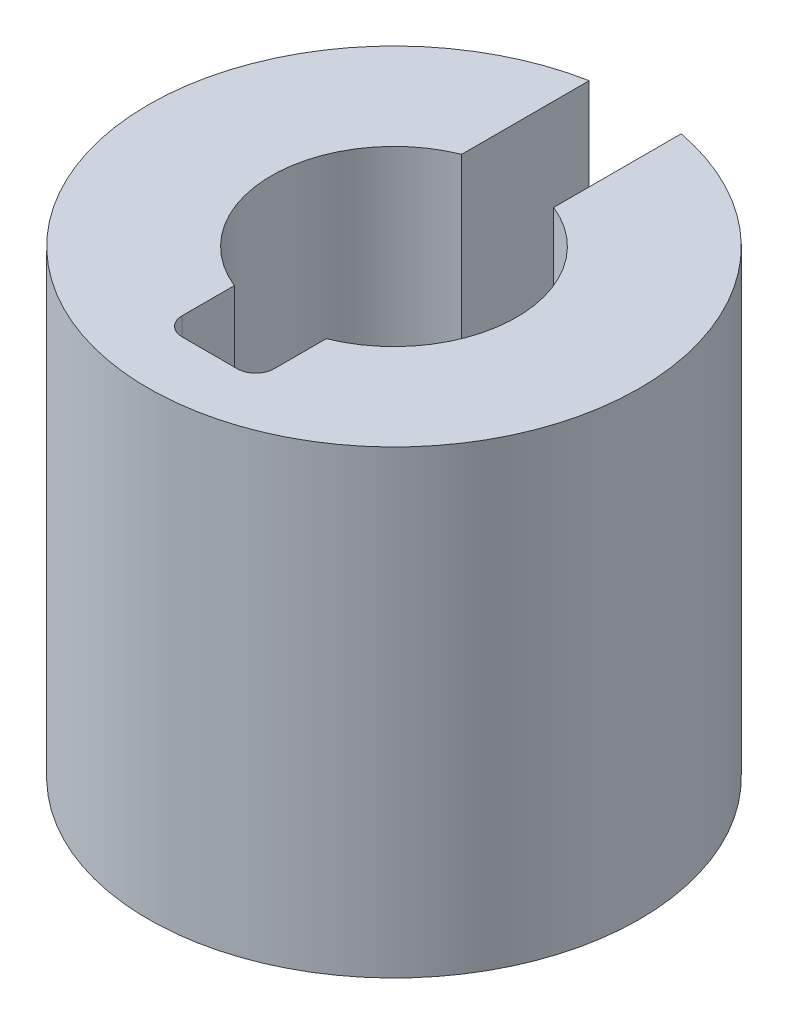
ISO-10303-21;
HEADER;
FILE_DESCRIPTION(('STEP AP214'),'2;1');
FILE_NAME('part.step','',(''),(''),'','','');
FILE_SCHEMA(('AUTOMOTIVE_DESIGN { 1 0 10303 214 1 1 1 1 }'));
ENDSEC;
DATA;
#1=APPLICATION_CONTEXT('core data for automotive mechanical design processes');
#2=APPLICATION_PROTOCOL_DEFINITION('international standard','automotive_design',2000,#1);
#3=PRODUCT_CONTEXT('',#1,'mechanical');
#4=PRODUCT('Part','Part','',(#3));
#5=PRODUCT_RELATED_PRODUCT_CATEGORY('part','',(#4));
#6=PRODUCT_DEFINITION_FORMATION('','',#4);
#7=PRODUCT_DEFINITION_CONTEXT('part definition',#1,'design');
#8=PRODUCT_DEFINITION('design','',#6,#7);
#9=PRODUCT_DEFINITION_SHAPE('','',#8);
#10=(LENGTH_UNIT() NAMED_UNIT(*) SI_UNIT(.MILLI.,.METRE.));
#11=(NAMED_UNIT(*) PLANE_ANGLE_UNIT() SI_UNIT($,.RADIAN.));
#12=(NAMED_UNIT(*) SI_UNIT($,.STERADIAN.) SOLID_ANGLE_UNIT());
#13=UNCERTAINTY_MEASURE_WITH_UNIT(LENGTH_MEASURE(1.E-05),#10,'distance_accuracy_value','');
#14=(GEOMETRIC_REPRESENTATION_CONTEXT(3) GLOBAL_UNCERTAINTY_ASSIGNED_CONTEXT((#13)) GLOBAL_UNIT_ASSIGNED_CONTEXT((#10,
#11,#12)) REPRESENTATION_CONTEXT('',''));
#15=CARTESIAN_POINT('',(0.,0.,0.));
#16=DIRECTION('',(0.,0.,1.));
#17=DIRECTION('',(1.,0.,0.));
#18=AXIS2_PLACEMENT_3D('',#15,#16,#17);
#19=CARTESIAN_POINT('',(-0.75,3.75,3.005));
#20=DIRECTION('',(0.,0.,1.));
#21=DIRECTION('',(1.,0.,0.));
#22=AXIS2_PLACEMENT_3D('',#19,#20,#21);
#23=PLANE('',#22);
#24=DIRECTION('',(0.,1.,0.));
#25=VECTOR('',#24,1.);
#26=CARTESIAN_POINT('',(-0.45,3.75,3.005));
#27=LINE('',#26,#25);
#28=CARTESIAN_POINT('',(-0.45,-3.75,3.005));
#29=VERTEX_POINT('',#28);
#30=CARTESIAN_POINT('',(-0.45,3.75,3.005));
#31=VERTEX_POINT('',#30);
#32=EDGE_CURVE('E114',#29,#31,#27,.T.);
#33=ORIENTED_EDGE('',*,*,#32,.T.);
#34=DIRECTION('',(1.,0.,0.));
#35=VECTOR('',#34,1.);
#36=CARTESIAN_POINT('',(-0.75,3.75,3.005));
#37=LINE('',#36,#35);
#38=CARTESIAN_POINT('',(0.45,3.75,3.005));
#39=VERTEX_POINT('',#38);
#40=EDGE_CURVE('E102',#39,#31,#37,.F.);
#41=ORIENTED_EDGE('',*,*,#40,.F.);
#42=DIRECTION('',(0.,1.,0.));
#43=VECTOR('',#42,1.);
#44=CARTESIAN_POINT('',(0.45,3.75,3.005));
#45=LINE('',#44,#43);
#46=CARTESIAN_POINT('',(0.45,-3.75,3.005));
#47=VERTEX_POINT('',#46);
#48=EDGE_CURVE('E101',#39,#47,#45,.F.);
#49=ORIENTED_EDGE('',*,*,#48,.T.);
#50=DIRECTION('',(1.,0.,0.));
#51=VECTOR('',#50,1.);
#52=CARTESIAN_POINT('',(-0.75,-3.75,3.005));
#53=LINE('',#52,#51);
#54=EDGE_CURVE('E91',#29,#47,#53,.T.);
#55=ORIENTED_EDGE('',*,*,#54,.F.);
#56=EDGE_LOOP('',(#33,#41,#49,#55));
#57=FACE_BOUND('',#56,.T.);
#58=ADVANCED_FACE('F16',(#57),#23,.F.);
#59=CARTESIAN_POINT('',(0.45,3.75,2.705));
#60=DIRECTION('',(0.,1.,0.));
#61=DIRECTION('',(0.,0.,1.));
#62=AXIS2_PLACEMENT_3D('',#59,#60,#61);
#63=CYLINDRICAL_SURFACE('',#62,0.3);
#64=DIRECTION('',(0.,1.,0.));
#65=VECTOR('',#64,1.);
#66=CARTESIAN_POINT('',(0.75,3.75,2.705));
#67=LINE('',#66,#65);
#68=CARTESIAN_POINT('',(0.75,3.75,2.705));
#69=VERTEX_POINT('',#68);
#70=CARTESIAN_POINT('',(0.75,-3.75,2.705));
#71=VERTEX_POINT('',#70);
#72=EDGE_CURVE('E111',#69,#71,#67,.F.);
#73=ORIENTED_EDGE('',*,*,#72,.T.);
#74=CARTESIAN_POINT('',(0.45,-3.75,2.705));
#75=DIRECTION('',(0.,1.,0.));
#76=DIRECTION('',(0.,0.,1.));
#77=AXIS2_PLACEMENT_3D('',#74,#75,#76);
#78=CIRCLE('',#77,0.3);
#79=EDGE_CURVE('E19',#47,#71,#78,.T.);
#80=ORIENTED_EDGE('',*,*,#79,.F.);
#81=ORIENTED_EDGE('',*,*,#48,.F.);
#82=CARTESIAN_POINT('',(0.45,3.75,2.705));
#83=DIRECTION('',(0.,1.,0.));
#84=DIRECTION('',(0.,0.,1.));
#85=AXIS2_PLACEMENT_3D('',#82,#83,#84);
#86=CIRCLE('',#85,0.3);
#87=EDGE_CURVE('E113',#69,#39,#86,.F.);
#88=ORIENTED_EDGE('',*,*,#87,.F.);
#89=EDGE_LOOP('',(#73,#80,#81,#88));
#90=FACE_BOUND('',#89,.T.);
#91=ADVANCED_FACE('F109',(#90),#63,.F.);
#92=CARTESIAN_POINT('',(-0.45,3.75,2.705));
#93=DIRECTION('',(0.,1.,0.));
#94=DIRECTION('',(0.,0.,1.));
#95=AXIS2_PLACEMENT_3D('',#92,#93,#94);
#96=CYLINDRICAL_SURFACE('',#95,0.3);
#97=ORIENTED_EDGE('',*,*,#32,.F.);
#98=CARTESIAN_POINT('',(-0.45,-3.75,2.705));
#99=DIRECTION('',(0.,1.,0.));
#100=DIRECTION('',(0.,0.,1.));
#101=AXIS2_PLACEMENT_3D('',#98,#99,#100);
#102=CIRCLE('',#101,0.3);
#103=CARTESIAN_POINT('',(-0.75,-3.75,2.705));
#104=VERTEX_POINT('',#103);
#105=EDGE_CURVE('E97',#104,#29,#102,.T.);
#106=ORIENTED_EDGE('',*,*,#105,.F.);
#107=DIRECTION('',(0.,1.,0.));
#108=VECTOR('',#107,1.);
#109=CARTESIAN_POINT('',(-0.75,3.75,2.705));
#110=LINE('',#109,#108);
#111=CARTESIAN_POINT('',(-0.75,3.75,2.705));
#112=VERTEX_POINT('',#111);
#113=EDGE_CURVE('E145',#104,#112,#110,.T.);
#114=ORIENTED_EDGE('',*,*,#113,.T.);
#115=CARTESIAN_POINT('',(-0.45,3.75,2.705));
#116=DIRECTION('',(0.,1.,0.));
#117=DIRECTION('',(0.,0.,1.));
#118=AXIS2_PLACEMENT_3D('',#115,#116,#117);
#119=CIRCLE('',#118,0.3);
#120=EDGE_CURVE('E117',#31,#112,#119,.F.);
#121=ORIENTED_EDGE('',*,*,#120,.F.);
#122=EDGE_LOOP('',(#97,#106,#114,#121));
#123=FACE_BOUND('',#122,.T.);
#124=ADVANCED_FACE('F183',(#123),#96,.F.);
#125=CARTESIAN_POINT('',(0.75,3.75,3.005));
#126=DIRECTION('',(1.,0.,0.));
#127=DIRECTION('',(0.,0.,-1.));
#128=AXIS2_PLACEMENT_3D('',#125,#126,#127);
#129=PLANE('',#128);
#130=ORIENTED_EDGE('',*,*,#72,.F.);
#131=DIRECTION('',(0.,0.,-1.));
#132=VECTOR('',#131,1.);
#133=CARTESIAN_POINT('',(0.75,3.75,3.005));
#134=LINE('',#133,#132);
#135=CARTESIAN_POINT('',(0.75,3.75,1.85404962177392));
#136=VERTEX_POINT('',#135);
#137=EDGE_CURVE('E119',#136,#69,#134,.F.);
#138=ORIENTED_EDGE('',*,*,#137,.F.);
#139=DIRECTION('',(0.,-1.,0.));
#140=VECTOR('',#139,1.);
#141=CARTESIAN_POINT('',(0.75,3.75,1.85404962177392));
#142=LINE('',#141,#140);
#143=CARTESIAN_POINT('',(0.75,-3.75,1.85404962177392));
#144=VERTEX_POINT('',#143);
#145=EDGE_CURVE('E153',#136,#144,#142,.T.);
#146=ORIENTED_EDGE('',*,*,#145,.T.);
#147=DIRECTION('',(0.,0.,-1.));
#148=VECTOR('',#147,1.);
#149=CARTESIAN_POINT('',(0.75,-3.75,3.005));
#150=LINE('',#149,#148);
#151=EDGE_CURVE('E144',#71,#144,#150,.T.);
#152=ORIENTED_EDGE('',*,*,#151,.F.);
#153=EDGE_LOOP('',(#130,#138,#146,#152));
#154=FACE_BOUND('',#153,.T.);
#155=ADVANCED_FACE('F180',(#154),#129,.F.);
#156=CARTESIAN_POINT('',(-0.75,3.75,3.005));
#157=DIRECTION('',(-1.,0.,0.));
#158=DIRECTION('',(0.,0.,1.));
#159=AXIS2_PLACEMENT_3D('',#156,#157,#158);
#160=PLANE('',#159);
#161=ORIENTED_EDGE('',*,*,#113,.F.);
#162=DIRECTION('',(0.,0.,1.));
#163=VECTOR('',#162,1.);
#164=CARTESIAN_POINT('',(-0.75,-3.75,3.005));
#165=LINE('',#164,#163);
#166=CARTESIAN_POINT('',(-0.75,-3.75,1.85404962177392));
#167=VERTEX_POINT('',#166);
#168=EDGE_CURVE('E149',#167,#104,#165,.T.);
#169=ORIENTED_EDGE('',*,*,#168,.F.);
#170=DIRECTION('',(0.,-1.,0.));
#171=VECTOR('',#170,1.);
#172=CARTESIAN_POINT('',(-0.749999999999999,3.75,1.85404962177392));
#173=LINE('',#172,#171);
#174=CARTESIAN_POINT('',(-0.75,3.75,1.85404962177392));
#175=VERTEX_POINT('',#174);
#176=EDGE_CURVE('E123',#167,#175,#173,.F.);
#177=ORIENTED_EDGE('',*,*,#176,.T.);
#178=DIRECTION('',(0.,0.,1.));
#179=VECTOR('',#178,1.);
#180=CARTESIAN_POINT('',(-0.75,3.75,3.005));
#181=LINE('',#180,#179);
#182=EDGE_CURVE('E148',#112,#175,#181,.F.);
#183=ORIENTED_EDGE('',*,*,#182,.F.);
#184=EDGE_LOOP('',(#161,#169,#177,#183));
#185=FACE_BOUND('',#184,.T.);
#186=ADVANCED_FACE('F182',(#185),#160,.F.);
#187=CARTESIAN_POINT('',(0.,3.75,0.));
#188=DIRECTION('',(0.,-1.,0.));
#189=DIRECTION('',(0.,0.,-1.));
#190=AXIS2_PLACEMENT_3D('',#187,#188,#189);
#191=CYLINDRICAL_SURFACE('',#190,2.);
#192=ORIENTED_EDGE('',*,*,#145,.F.);
#193=CARTESIAN_POINT('',(0.,3.75,0.));
#194=DIRECTION('',(0.,-1.,0.));
#195=DIRECTION('',(0.,0.,-1.));
#196=AXIS2_PLACEMENT_3D('',#193,#194,#195);
#197=CIRCLE('',#196,2.);
#198=CARTESIAN_POINT('',(0.75,3.75,-1.85404962177392));
#199=VERTEX_POINT('',#198);
#200=EDGE_CURVE('E127',#199,#136,#197,.T.);
#201=ORIENTED_EDGE('',*,*,#200,.F.);
#202=DIRECTION('',(0.,1.,0.));
#203=VECTOR('',#202,1.);
#204=CARTESIAN_POINT('',(0.75,3.75,-1.85404962177392));
#205=LINE('',#204,#203);
#206=CARTESIAN_POINT('',(0.75,-3.75,-1.85404962177392));
#207=VERTEX_POINT('',#206);
#208=EDGE_CURVE('E126',#199,#207,#205,.F.);
#209=ORIENTED_EDGE('',*,*,#208,.T.);
#210=CARTESIAN_POINT('',(0.,-3.75,0.));
#211=DIRECTION('',(0.,-1.,0.));
#212=DIRECTION('',(0.,0.,-1.));
#213=AXIS2_PLACEMENT_3D('',#210,#211,#212);
#214=CIRCLE('',#213,2.);
#215=EDGE_CURVE('E122',#207,#144,#214,.T.);
#216=ORIENTED_EDGE('',*,*,#215,.T.);
#217=EDGE_LOOP('',(#192,#201,#209,#216));
#218=FACE_BOUND('',#217,.T.);
#219=ADVANCED_FACE('F178',(#218),#191,.F.);
#220=CARTESIAN_POINT('',(0.,3.75,0.));
#221=DIRECTION('',(0.,-1.,0.));
#222=DIRECTION('',(0.,0.,-1.));
#223=AXIS2_PLACEMENT_3D('',#220,#221,#222);
#224=CYLINDRICAL_SURFACE('',#223,2.);
#225=DIRECTION('',(0.,1.,0.));
#226=VECTOR('',#225,1.);
#227=CARTESIAN_POINT('',(-0.75,3.75,-1.85404962177392));
#228=LINE('',#227,#226);
#229=CARTESIAN_POINT('',(-0.75,-3.75,-1.85404962177392));
#230=VERTEX_POINT('',#229);
#231=CARTESIAN_POINT('',(-0.75,3.75,-1.85404962177392));
#232=VERTEX_POINT('',#231);
#233=EDGE_CURVE('E160',#230,#232,#228,.T.);
#234=ORIENTED_EDGE('',*,*,#233,.T.);
#235=CARTESIAN_POINT('',(0.,3.75,0.));
#236=DIRECTION('',(0.,-1.,0.));
#237=DIRECTION('',(0.,0.,-1.));
#238=AXIS2_PLACEMENT_3D('',#235,#236,#237);
#239=CIRCLE('',#238,2.);
#240=EDGE_CURVE('E130',#175,#232,#239,.T.);
#241=ORIENTED_EDGE('',*,*,#240,.F.);
#242=ORIENTED_EDGE('',*,*,#176,.F.);
#243=CARTESIAN_POINT('',(0.,-3.75,0.));
#244=DIRECTION('',(0.,-1.,0.));
#245=DIRECTION('',(0.,0.,-1.));
#246=AXIS2_PLACEMENT_3D('',#243,#244,#245);
#247=CIRCLE('',#246,2.);
#248=EDGE_CURVE('E120',#167,#230,#247,.T.);
#249=ORIENTED_EDGE('',*,*,#248,.T.);
#250=EDGE_LOOP('',(#234,#241,#242,#249));
#251=FACE_BOUND('',#250,.T.);
#252=ADVANCED_FACE('F211',(#251),#224,.F.);
#253=CARTESIAN_POINT('',(0.,-3.75,0.));
#254=DIRECTION('',(0.,1.,0.));
#255=DIRECTION('',(0.,0.,1.));
#256=AXIS2_PLACEMENT_3D('',#253,#254,#255);
#257=PLANE('',#256);
#258=DIRECTION('',(0.,0.,-1.));
#259=VECTOR('',#258,1.);
#260=CARTESIAN_POINT('',(0.75,-3.75,-1.85404962177392));
#261=LINE('',#260,#259);
#262=CARTESIAN_POINT('',(0.75,-3.75,-3.9341485737069));
#263=VERTEX_POINT('',#262);
#264=EDGE_CURVE('E131',#207,#263,#261,.T.);
#265=ORIENTED_EDGE('',*,*,#264,.T.);
#266=CARTESIAN_POINT('',(0.,-3.75,0.));
#267=DIRECTION('',(0.,-1.,0.));
#268=DIRECTION('',(0.,0.,-1.));
#269=AXIS2_PLACEMENT_3D('',#266,#267,#268);
#270=CIRCLE('',#269,4.005);
#271=CARTESIAN_POINT('',(-0.75,-3.75,-3.9341485737069));
#272=VERTEX_POINT('',#271);
#273=EDGE_CURVE('E134',#272,#263,#270,.F.);
#274=ORIENTED_EDGE('',*,*,#273,.F.);
#275=DIRECTION('',(0.,0.,1.));
#276=VECTOR('',#275,1.);
#277=CARTESIAN_POINT('',(-0.75,-3.75,-1.85404962177392));
#278=LINE('',#277,#276);
#279=EDGE_CURVE('E138',#272,#230,#278,.T.);
#280=ORIENTED_EDGE('',*,*,#279,.T.);
#281=ORIENTED_EDGE('',*,*,#248,.F.);
#282=ORIENTED_EDGE('',*,*,#168,.T.);
#283=ORIENTED_EDGE('',*,*,#105,.T.);
#284=ORIENTED_EDGE('',*,*,#54,.T.);
#285=ORIENTED_EDGE('',*,*,#79,.T.);
#286=ORIENTED_EDGE('',*,*,#151,.T.);
#287=ORIENTED_EDGE('',*,*,#215,.F.);
#288=EDGE_LOOP('',(#265,#274,#280,#281,#282,#283,#284,#285,#286,#287));
#289=FACE_BOUND('',#288,.T.);
#290=ADVANCED_FACE('F93',(#289),#257,.F.);
#291=CARTESIAN_POINT('',(0.75,3.75,-1.85404962177392));
#292=DIRECTION('',(1.,0.,0.));
#293=DIRECTION('',(0.,0.,-1.));
#294=AXIS2_PLACEMENT_3D('',#291,#292,#293);
#295=PLANE('',#294);
#296=ORIENTED_EDGE('',*,*,#208,.F.);
#297=DIRECTION('',(0.,0.,1.));
#298=VECTOR('',#297,1.);
#299=CARTESIAN_POINT('',(0.75,3.75,0.));
#300=LINE('',#299,#298);
#301=CARTESIAN_POINT('',(0.75,3.75,-3.9341485737069));
#302=VERTEX_POINT('',#301);
#303=EDGE_CURVE('E133',#302,#199,#300,.T.);
#304=ORIENTED_EDGE('',*,*,#303,.F.);
#305=DIRECTION('',(0.,-1.,0.));
#306=VECTOR('',#305,1.);
#307=CARTESIAN_POINT('',(0.75,3.75,-3.9341485737069));
#308=LINE('',#307,#306);
#309=EDGE_CURVE('E137',#263,#302,#308,.F.);
#310=ORIENTED_EDGE('',*,*,#309,.F.);
#311=ORIENTED_EDGE('',*,*,#264,.F.);
#312=EDGE_LOOP('',(#296,#304,#310,#311));
#313=FACE_BOUND('',#312,.T.);
#314=ADVANCED_FACE('F173',(#313),#295,.F.);
#315=CARTESIAN_POINT('',(0.,3.75,0.));
#316=DIRECTION('',(0.,1.,0.));
#317=DIRECTION('',(0.,0.,1.));
#318=AXIS2_PLACEMENT_3D('',#315,#316,#317);
#319=PLANE('',#318);
#320=CARTESIAN_POINT('',(0.,3.75,0.));
#321=DIRECTION('',(0.,-1.,0.));
#322=DIRECTION('',(0.,0.,-1.));
#323=AXIS2_PLACEMENT_3D('',#320,#321,#322);
#324=CIRCLE('',#323,4.005);
#325=CARTESIAN_POINT('',(-0.75,3.75,-3.9341485737069));
#326=VERTEX_POINT('',#325);
#327=EDGE_CURVE('E25',#302,#326,#324,.T.);
#328=ORIENTED_EDGE('',*,*,#327,.F.);
#329=ORIENTED_EDGE('',*,*,#303,.T.);
#330=ORIENTED_EDGE('',*,*,#200,.T.);
#331=ORIENTED_EDGE('',*,*,#137,.T.);
#332=ORIENTED_EDGE('',*,*,#87,.T.);
#333=ORIENTED_EDGE('',*,*,#40,.T.);
#334=ORIENTED_EDGE('',*,*,#120,.T.);
#335=ORIENTED_EDGE('',*,*,#182,.T.);
#336=ORIENTED_EDGE('',*,*,#240,.T.);
#337=DIRECTION('',(0.,0.,1.));
#338=VECTOR('',#337,1.);
#339=CARTESIAN_POINT('',(-0.75,3.75,-1.85404962177392));
#340=LINE('',#339,#338);
#341=EDGE_CURVE('E34',#232,#326,#340,.F.);
#342=ORIENTED_EDGE('',*,*,#341,.T.);
#343=EDGE_LOOP('',(#328,#329,#330,#331,#332,#333,#334,#335,#336,#342));
#344=FACE_BOUND('',#343,.T.);
#345=ADVANCED_FACE('F169',(#344),#319,.T.);
#346=CARTESIAN_POINT('',(-0.75,3.75,-1.85404962177392));
#347=DIRECTION('',(-1.,0.,0.));
#348=DIRECTION('',(0.,0.,1.));
#349=AXIS2_PLACEMENT_3D('',#346,#347,#348);
#350=PLANE('',#349);
#351=DIRECTION('',(0.,-1.,0.));
#352=VECTOR('',#351,1.);
#353=CARTESIAN_POINT('',(-0.75,3.75,-3.9341485737069));
#354=LINE('',#353,#352);
#355=EDGE_CURVE('E10',#326,#272,#354,.T.);
#356=ORIENTED_EDGE('',*,*,#355,.F.);
#357=ORIENTED_EDGE('',*,*,#341,.F.);
#358=ORIENTED_EDGE('',*,*,#233,.F.);
#359=ORIENTED_EDGE('',*,*,#279,.F.);
#360=EDGE_LOOP('',(#356,#357,#358,#359));
#361=FACE_BOUND('',#360,.T.);
#362=ADVANCED_FACE('F196',(#361),#350,.F.);
#363=CARTESIAN_POINT('',(0.,3.75,0.));
#364=DIRECTION('',(0.,-1.,0.));
#365=DIRECTION('',(0.,0.,-1.));
#366=AXIS2_PLACEMENT_3D('',#363,#364,#365);
#367=CYLINDRICAL_SURFACE('',#366,4.005);
#368=ORIENTED_EDGE('',*,*,#327,.T.);
#369=ORIENTED_EDGE('',*,*,#355,.T.);
#370=ORIENTED_EDGE('',*,*,#273,.T.);
#371=ORIENTED_EDGE('',*,*,#309,.T.);
#372=EDGE_LOOP('',(#368,#369,#370,#371));
#373=FACE_BOUND('',#372,.T.);
#374=ADVANCED_FACE('F194',(#373),#367,.T.);
#375=CLOSED_SHELL('',(#58,#91,#124,#155,#186,#219,#252,#290,#314,#345,#362,#374));
#376=MANIFOLD_SOLID_BREP('B1',#375);
#377=ADVANCED_BREP_SHAPE_REPRESENTATION('',(#18,#376),#14);
#378=SHAPE_DEFINITION_REPRESENTATION(#9,#377);
ENDSEC;
END-ISO-10303-21;
